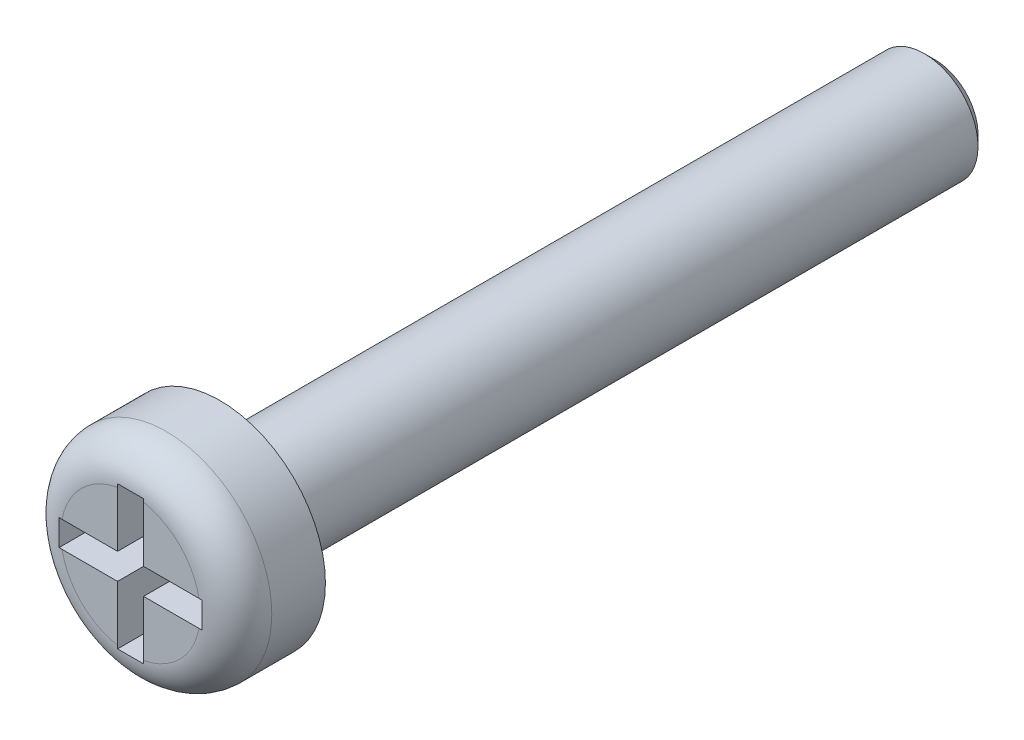
ISO-10303-21;
HEADER;
FILE_DESCRIPTION(('STEP AP214'),'2;1');
FILE_NAME('part.step','',(''),(''),'','','');
FILE_SCHEMA(('AUTOMOTIVE_DESIGN { 1 0 10303 214 1 1 1 1 }'));
ENDSEC;
DATA;
#1=APPLICATION_CONTEXT('core data for automotive mechanical design processes');
#2=APPLICATION_PROTOCOL_DEFINITION('international standard','automotive_design',2000,#1);
#3=PRODUCT_CONTEXT('',#1,'mechanical');
#4=PRODUCT('Part','Part','',(#3));
#5=PRODUCT_RELATED_PRODUCT_CATEGORY('part','',(#4));
#6=PRODUCT_DEFINITION_FORMATION('','',#4);
#7=PRODUCT_DEFINITION_CONTEXT('part definition',#1,'design');
#8=PRODUCT_DEFINITION('design','',#6,#7);
#9=PRODUCT_DEFINITION_SHAPE('','',#8);
#10=(LENGTH_UNIT() NAMED_UNIT(*) SI_UNIT(.MILLI.,.METRE.));
#11=(NAMED_UNIT(*) PLANE_ANGLE_UNIT() SI_UNIT($,.RADIAN.));
#12=(NAMED_UNIT(*) SI_UNIT($,.STERADIAN.) SOLID_ANGLE_UNIT());
#13=UNCERTAINTY_MEASURE_WITH_UNIT(LENGTH_MEASURE(1.E-05),#10,'distance_accuracy_value','');
#14=(GEOMETRIC_REPRESENTATION_CONTEXT(3) GLOBAL_UNCERTAINTY_ASSIGNED_CONTEXT((#13)) GLOBAL_UNIT_ASSIGNED_CONTEXT((#10,
#11,#12)) REPRESENTATION_CONTEXT('',''));
#15=CARTESIAN_POINT('',(0.,0.,0.));
#16=DIRECTION('',(0.,0.,1.));
#17=DIRECTION('',(1.,0.,0.));
#18=AXIS2_PLACEMENT_3D('',#15,#16,#17);
#19=CARTESIAN_POINT('',(0.,0.,2.5));
#20=DIRECTION('',(0.,0.,1.));
#21=DIRECTION('',(1.,0.,0.));
#22=AXIS2_PLACEMENT_3D('',#19,#20,#21);
#23=PLANE('',#22);
#24=DIRECTION('',(0.,-1.,0.));
#25=VECTOR('',#24,1.);
#26=CARTESIAN_POINT('',(-0.363589324194442,0.363589324194443,2.5));
#27=LINE('',#26,#25);
#28=CARTESIAN_POINT('',(-0.363589324194442,1.915803435463,2.5));
#29=VERTEX_POINT('',#28);
#30=CARTESIAN_POINT('',(-0.363589324194442,0.363589324194443,2.5));
#31=VERTEX_POINT('',#30);
#32=EDGE_CURVE('E217',#29,#31,#27,.T.);
#33=ORIENTED_EDGE('',*,*,#32,.F.);
#34=CARTESIAN_POINT('',(0.,0.,2.5));
#35=DIRECTION('',(0.,0.,1.));
#36=DIRECTION('',(1.,0.,0.));
#37=AXIS2_PLACEMENT_3D('',#34,#35,#36);
#38=CIRCLE('',#37,1.95);
#39=CARTESIAN_POINT('',(-1.915803435463,0.363589324194443,2.5));
#40=VERTEX_POINT('',#39);
#41=EDGE_CURVE('E269',#29,#40,#38,.T.);
#42=ORIENTED_EDGE('',*,*,#41,.T.);
#43=DIRECTION('',(-1.,0.,0.));
#44=VECTOR('',#43,1.);
#45=CARTESIAN_POINT('',(-2.,0.363589324194443,2.5));
#46=LINE('',#45,#44);
#47=EDGE_CURVE('E219',#31,#40,#46,.T.);
#48=ORIENTED_EDGE('',*,*,#47,.F.);
#49=EDGE_LOOP('',(#33,#42,#48));
#50=FACE_BOUND('',#49,.T.);
#51=ADVANCED_FACE('F37',(#50),#23,.T.);
#52=DIRECTION('',(1.,0.,0.));
#53=VECTOR('',#52,1.);
#54=CARTESIAN_POINT('',(-2.,-0.363589324194442,2.5));
#55=LINE('',#54,#53);
#56=CARTESIAN_POINT('',(-1.915803435463,-0.363589324194442,2.5));
#57=VERTEX_POINT('',#56);
#58=CARTESIAN_POINT('',(-0.363589324194442,-0.363589324194442,2.5));
#59=VERTEX_POINT('',#58);
#60=EDGE_CURVE('E182',#57,#59,#55,.T.);
#61=ORIENTED_EDGE('',*,*,#60,.F.);
#62=CARTESIAN_POINT('',(0.,0.,2.5));
#63=DIRECTION('',(0.,0.,1.));
#64=DIRECTION('',(1.,0.,0.));
#65=AXIS2_PLACEMENT_3D('',#62,#63,#64);
#66=CIRCLE('',#65,1.95);
#67=CARTESIAN_POINT('',(-0.363589324194442,-1.915803435463,2.5));
#68=VERTEX_POINT('',#67);
#69=EDGE_CURVE('E267',#57,#68,#66,.T.);
#70=ORIENTED_EDGE('',*,*,#69,.T.);
#71=DIRECTION('',(0.,-1.,0.));
#72=VECTOR('',#71,1.);
#73=CARTESIAN_POINT('',(-0.363589324194442,-2.,2.5));
#74=LINE('',#73,#72);
#75=EDGE_CURVE('E179',#59,#68,#74,.T.);
#76=ORIENTED_EDGE('',*,*,#75,.F.);
#77=EDGE_LOOP('',(#61,#70,#76));
#78=FACE_BOUND('',#77,.T.);
#79=ADVANCED_FACE('F386',(#78),#23,.T.);
#80=DIRECTION('',(0.,1.,0.));
#81=VECTOR('',#80,1.);
#82=CARTESIAN_POINT('',(0.363589324194442,-2.,2.5));
#83=LINE('',#82,#81);
#84=CARTESIAN_POINT('',(0.363589324194442,-1.915803435463,2.5));
#85=VERTEX_POINT('',#84);
#86=CARTESIAN_POINT('',(0.363589324194442,-0.363589324194442,2.5));
#87=VERTEX_POINT('',#86);
#88=EDGE_CURVE('E160',#85,#87,#83,.T.);
#89=ORIENTED_EDGE('',*,*,#88,.F.);
#90=CARTESIAN_POINT('',(0.,0.,2.5));
#91=DIRECTION('',(0.,0.,1.));
#92=DIRECTION('',(1.,0.,0.));
#93=AXIS2_PLACEMENT_3D('',#90,#91,#92);
#94=CIRCLE('',#93,1.95);
#95=CARTESIAN_POINT('',(1.915803435463,-0.363589324194442,2.5));
#96=VERTEX_POINT('',#95);
#97=EDGE_CURVE('E265',#85,#96,#94,.T.);
#98=ORIENTED_EDGE('',*,*,#97,.T.);
#99=DIRECTION('',(1.,0.,0.));
#100=VECTOR('',#99,1.);
#101=CARTESIAN_POINT('',(0.363589324194442,-0.363589324194442,2.5));
#102=LINE('',#101,#100);
#103=EDGE_CURVE('E211',#87,#96,#102,.T.);
#104=ORIENTED_EDGE('',*,*,#103,.F.);
#105=EDGE_LOOP('',(#89,#98,#104));
#106=FACE_BOUND('',#105,.T.);
#107=ADVANCED_FACE('F372',(#106),#23,.T.);
#108=CARTESIAN_POINT('',(0.,0.,0.));
#109=DIRECTION('',(0.,0.,1.));
#110=DIRECTION('',(1.,0.,0.));
#111=AXIS2_PLACEMENT_3D('',#108,#109,#110);
#112=PLANE('',#111);
#113=CARTESIAN_POINT('',(0.,0.,0.));
#114=DIRECTION('',(0.,0.,1.));
#115=DIRECTION('',(1.,0.,0.));
#116=AXIS2_PLACEMENT_3D('',#113,#114,#115);
#117=CIRCLE('',#116,2.95);
#118=CARTESIAN_POINT('',(2.95,0.,0.));
#119=VERTEX_POINT('',#118);
#120=EDGE_CURVE('E225',#119,#119,#117,.T.);
#121=ORIENTED_EDGE('',*,*,#120,.F.);
#122=EDGE_LOOP('',(#121));
#123=FACE_BOUND('',#122,.T.);
#124=CARTESIAN_POINT('',(0.,0.,0.));
#125=DIRECTION('',(0.,0.,1.));
#126=DIRECTION('',(1.,0.,0.));
#127=AXIS2_PLACEMENT_3D('',#124,#125,#126);
#128=CIRCLE('',#127,1.5);
#129=CARTESIAN_POINT('',(1.5,0.,0.));
#130=VERTEX_POINT('',#129);
#131=EDGE_CURVE('E254',#130,#130,#128,.F.);
#132=ORIENTED_EDGE('',*,*,#131,.F.);
#133=EDGE_LOOP('',(#132));
#134=FACE_BOUND('',#133,.T.);
#135=ADVANCED_FACE('F373',(#123,#134),#112,.F.);
#136=CARTESIAN_POINT('',(0.,0.,2.5));
#137=DIRECTION('',(0.,0.,-1.));
#138=DIRECTION('',(-1.,0.,0.));
#139=AXIS2_PLACEMENT_3D('',#136,#137,#138);
#140=CYLINDRICAL_SURFACE('',#139,2.95);
#141=CARTESIAN_POINT('',(0.,0.,1.5));
#142=DIRECTION('',(0.,0.,1.));
#143=DIRECTION('',(1.,0.,0.));
#144=AXIS2_PLACEMENT_3D('',#141,#142,#143);
#145=CIRCLE('',#144,2.95);
#146=CARTESIAN_POINT('',(2.95,0.,1.5));
#147=VERTEX_POINT('',#146);
#148=EDGE_CURVE('E11',#147,#147,#145,.F.);
#149=ORIENTED_EDGE('',*,*,#148,.T.);
#150=EDGE_LOOP('',(#149));
#151=FACE_BOUND('',#150,.T.);
#152=ORIENTED_EDGE('',*,*,#120,.T.);
#153=EDGE_LOOP('',(#152));
#154=FACE_BOUND('',#153,.T.);
#155=ADVANCED_FACE('F370',(#151,#154),#140,.T.);
#156=DIRECTION('',(-1.,0.,0.));
#157=VECTOR('',#156,1.);
#158=CARTESIAN_POINT('',(0.363589324194442,0.363589324194443,2.5));
#159=LINE('',#158,#157);
#160=CARTESIAN_POINT('',(1.915803435463,0.363589324194443,2.5));
#161=VERTEX_POINT('',#160);
#162=CARTESIAN_POINT('',(0.363589324194442,0.363589324194443,2.5));
#163=VERTEX_POINT('',#162);
#164=EDGE_CURVE('E213',#161,#163,#159,.T.);
#165=ORIENTED_EDGE('',*,*,#164,.F.);
#166=CARTESIAN_POINT('',(0.,0.,2.5));
#167=DIRECTION('',(0.,0.,1.));
#168=DIRECTION('',(1.,0.,0.));
#169=AXIS2_PLACEMENT_3D('',#166,#167,#168);
#170=CIRCLE('',#169,1.95);
#171=CARTESIAN_POINT('',(0.363589324194442,1.915803435463,2.5));
#172=VERTEX_POINT('',#171);
#173=EDGE_CURVE('E263',#161,#172,#170,.T.);
#174=ORIENTED_EDGE('',*,*,#173,.T.);
#175=DIRECTION('',(0.,1.,0.));
#176=VECTOR('',#175,1.);
#177=CARTESIAN_POINT('',(0.363589324194442,0.363589324194443,2.5));
#178=LINE('',#177,#176);
#179=EDGE_CURVE('E215',#163,#172,#178,.T.);
#180=ORIENTED_EDGE('',*,*,#179,.F.);
#181=EDGE_LOOP('',(#165,#174,#180));
#182=FACE_BOUND('',#181,.T.);
#183=ADVANCED_FACE('F366',(#182),#23,.T.);
#184=CARTESIAN_POINT('',(0.,0.,-20.));
#185=DIRECTION('',(0.,0.,1.));
#186=DIRECTION('',(1.,0.,0.));
#187=AXIS2_PLACEMENT_3D('',#184,#185,#186);
#188=CYLINDRICAL_SURFACE('',#187,1.5);
#189=CARTESIAN_POINT('',(0.,0.,-19.7));
#190=DIRECTION('',(0.,0.,-1.));
#191=DIRECTION('',(-1.,0.,0.));
#192=AXIS2_PLACEMENT_3D('',#189,#190,#191);
#193=CIRCLE('',#192,1.5);
#194=CARTESIAN_POINT('',(-1.5,0.,-19.7));
#195=VERTEX_POINT('',#194);
#196=EDGE_CURVE('E260',#195,#195,#193,.F.);
#197=ORIENTED_EDGE('',*,*,#196,.T.);
#198=EDGE_LOOP('',(#197));
#199=FACE_BOUND('',#198,.T.);
#200=ORIENTED_EDGE('',*,*,#131,.T.);
#201=EDGE_LOOP('',(#200));
#202=FACE_BOUND('',#201,.T.);
#203=ADVANCED_FACE('F362',(#199,#202),#188,.T.);
#204=CARTESIAN_POINT('',(0.,0.,-20.));
#205=DIRECTION('',(0.,0.,-1.));
#206=DIRECTION('',(-1.,0.,0.));
#207=AXIS2_PLACEMENT_3D('',#204,#205,#206);
#208=PLANE('',#207);
#209=CARTESIAN_POINT('',(0.,0.,-20.));
#210=DIRECTION('',(0.,0.,-1.));
#211=DIRECTION('',(-1.,0.,0.));
#212=AXIS2_PLACEMENT_3D('',#209,#210,#211);
#213=CIRCLE('',#212,1.2);
#214=CARTESIAN_POINT('',(-1.2,0.,-20.));
#215=VERTEX_POINT('',#214);
#216=EDGE_CURVE('E257',#215,#215,#213,.T.);
#217=ORIENTED_EDGE('',*,*,#216,.T.);
#218=EDGE_LOOP('',(#217));
#219=FACE_BOUND('',#218,.T.);
#220=ADVANCED_FACE('F359',(#219),#208,.T.);
#221=CARTESIAN_POINT('',(0.,0.,-20.));
#222=DIRECTION('',(0.,0.,1.));
#223=DIRECTION('',(1.,0.,0.));
#224=AXIS2_PLACEMENT_3D('',#221,#222,#223);
#225=CONICAL_SURFACE('',#224,1.2,0.785398163397447);
#226=ORIENTED_EDGE('',*,*,#196,.F.);
#227=EDGE_LOOP('',(#226));
#228=FACE_BOUND('',#227,.T.);
#229=ORIENTED_EDGE('',*,*,#216,.F.);
#230=EDGE_LOOP('',(#229));
#231=FACE_BOUND('',#230,.T.);
#232=ADVANCED_FACE('F358',(#228,#231),#225,.T.);
#233=CARTESIAN_POINT('',(0.363589324194442,-2.,0.5));
#234=DIRECTION('',(1.,0.,0.));
#235=DIRECTION('',(0.,0.,-1.));
#236=AXIS2_PLACEMENT_3D('',#233,#234,#235);
#237=PLANE('',#236);
#238=DIRECTION('',(0.,0.,1.));
#239=VECTOR('',#238,1.);
#240=CARTESIAN_POINT('',(0.363589324194442,-2.,0.5));
#241=LINE('',#240,#239);
#242=CARTESIAN_POINT('',(0.363589324194442,-2.,0.5));
#243=VERTEX_POINT('',#242);
#244=CARTESIAN_POINT('',(0.363589324194442,-2.,2.49656779144265));
#245=VERTEX_POINT('',#244);
#246=EDGE_CURVE('E223',#243,#245,#241,.T.);
#247=ORIENTED_EDGE('',*,*,#246,.T.);
#248=CARTESIAN_POINT('',(0.363589324194442,-2.,2.49656779144265));
#249=CARTESIAN_POINT('',(0.363589324194442,-1.98599056173165,2.49771205782613));
#250=CARTESIAN_POINT('',(0.363589324194442,-1.97196946017275,2.49857020839763));
#251=CARTESIAN_POINT('',(0.363589324194442,-1.94390393864683,2.49971427758346));
#252=CARTESIAN_POINT('',(0.363589324194442,-1.92985951869339,2.50000019653109));
#253=CARTESIAN_POINT('',(0.363589324194442,-1.915803435463,2.5));
#254=B_SPLINE_CURVE_WITH_KNOTS('',3,(#248,#249,#250,#251,#252,#253),.UNSPECIFIED.,.F.,.F.,(4,2,
4),(0.,0.0421420146878945,0.084284004831425),.UNSPECIFIED.);
#255=EDGE_CURVE('E343',#245,#85,#254,.T.);
#256=ORIENTED_EDGE('',*,*,#255,.T.);
#257=ORIENTED_EDGE('',*,*,#88,.T.);
#258=DIRECTION('',(0.,0.,1.));
#259=VECTOR('',#258,1.);
#260=CARTESIAN_POINT('',(0.363589324194442,-0.363589324194442,0.5));
#261=LINE('',#260,#259);
#262=CARTESIAN_POINT('',(0.363589324194442,-0.363589324194442,0.5));
#263=VERTEX_POINT('',#262);
#264=EDGE_CURVE('E152',#263,#87,#261,.T.);
#265=ORIENTED_EDGE('',*,*,#264,.F.);
#266=DIRECTION('',(0.,1.,0.));
#267=VECTOR('',#266,1.);
#268=CARTESIAN_POINT('',(0.363589324194442,-2.,0.5));
#269=LINE('',#268,#267);
#270=EDGE_CURVE('E157',#243,#263,#269,.T.);
#271=ORIENTED_EDGE('',*,*,#270,.F.);
#272=EDGE_LOOP('',(#247,#256,#257,#265,#271));
#273=FACE_BOUND('',#272,.T.);
#274=ADVANCED_FACE('F155',(#273),#237,.F.);
#275=CARTESIAN_POINT('',(-0.363589324194442,-2.,0.5));
#276=DIRECTION('',(0.,-1.,0.));
#277=DIRECTION('',(0.,0.,-1.));
#278=AXIS2_PLACEMENT_3D('',#275,#276,#277);
#279=PLANE('',#278);
#280=DIRECTION('',(0.,0.,1.));
#281=VECTOR('',#280,1.);
#282=CARTESIAN_POINT('',(-0.363589324194442,-2.,0.5));
#283=LINE('',#282,#281);
#284=CARTESIAN_POINT('',(-0.363589324194442,-2.,0.5));
#285=VERTEX_POINT('',#284);
#286=CARTESIAN_POINT('',(-0.363589324194442,-2.,2.49656779144265));
#287=VERTEX_POINT('',#286);
#288=EDGE_CURVE('E226',#285,#287,#283,.T.);
#289=ORIENTED_EDGE('',*,*,#288,.T.);
#290=CARTESIAN_POINT('',(-0.363589324194442,-2.,2.49656779144265));
#291=CARTESIAN_POINT('',(-0.302993422672167,-2.,2.4974261728027));
#292=CARTESIAN_POINT('',(-0.242394946107263,-2.,2.49797153365682));
#293=CARTESIAN_POINT('',(-0.12119764629845,-2.,2.4986330482506));
#294=CARTESIAN_POINT('',(-0.060598823149225,-2.,2.49874921777191));
#295=CARTESIAN_POINT('',(0.0605988231492249,-2.,2.49874921777191));
#296=CARTESIAN_POINT('',(0.12119764629845,-2.,2.4986330482506));
#297=CARTESIAN_POINT('',(0.242394946107262,-2.,2.49797153365682));
#298=CARTESIAN_POINT('',(0.302993422672167,-2.,2.4974261728027));
#299=CARTESIAN_POINT('',(0.363589324194442,-2.,2.49656779144265));
#300=B_SPLINE_CURVE_WITH_KNOTS('',3,(#290,#291,#292,#293,#294,#295,#296,#297,#298,#299),
.UNSPECIFIED.,.F.,.F.,(4,2,2,2,4),(0.,0.181802416457,0.363598147850277,0.545393879243555,
0.727196295700555),.UNSPECIFIED.);
#301=EDGE_CURVE('E348',#287,#245,#300,.T.);
#302=ORIENTED_EDGE('',*,*,#301,.T.);
#303=ORIENTED_EDGE('',*,*,#246,.F.);
#304=DIRECTION('',(1.,0.,0.));
#305=VECTOR('',#304,1.);
#306=CARTESIAN_POINT('',(-0.363589324194442,-2.,0.5));
#307=LINE('',#306,#305);
#308=EDGE_CURVE('E165',#285,#243,#307,.T.);
#309=ORIENTED_EDGE('',*,*,#308,.F.);
#310=EDGE_LOOP('',(#289,#302,#303,#309));
#311=FACE_BOUND('',#310,.T.);
#312=ADVANCED_FACE('F357',(#311),#279,.F.);
#313=CARTESIAN_POINT('',(-0.363589324194442,-2.,0.5));
#314=DIRECTION('',(-1.,0.,0.));
#315=DIRECTION('',(0.,-1.,0.));
#316=AXIS2_PLACEMENT_3D('',#313,#314,#315);
#317=PLANE('',#316);
#318=ORIENTED_EDGE('',*,*,#75,.T.);
#319=CARTESIAN_POINT('',(-0.363589324194442,-1.915803435463,2.5));
#320=CARTESIAN_POINT('',(-0.363589324194442,-1.92985951869339,2.50000019653109));
#321=CARTESIAN_POINT('',(-0.363589324194442,-1.94390393864683,2.49971427758346));
#322=CARTESIAN_POINT('',(-0.363589324194442,-1.97196946017275,2.49857020839763));
#323=CARTESIAN_POINT('',(-0.363589324194442,-1.98599056173165,2.49771205782613));
#324=CARTESIAN_POINT('',(-0.363589324194442,-2.,2.49656779144265));
#325=B_SPLINE_CURVE_WITH_KNOTS('',3,(#319,#320,#321,#322,#323,#324),.UNSPECIFIED.,.F.,.F.,(4,2,
4),(0.,0.0421419901435307,0.0842840048314248),.UNSPECIFIED.);
#326=EDGE_CURVE('E562',#68,#287,#325,.T.);
#327=ORIENTED_EDGE('',*,*,#326,.T.);
#328=ORIENTED_EDGE('',*,*,#288,.F.);
#329=DIRECTION('',(0.,-1.,0.));
#330=VECTOR('',#329,1.);
#331=CARTESIAN_POINT('',(-0.363589324194442,-2.,0.5));
#332=LINE('',#331,#330);
#333=CARTESIAN_POINT('',(-0.363589324194442,-0.363589324194442,0.5));
#334=VERTEX_POINT('',#333);
#335=EDGE_CURVE('E207',#334,#285,#332,.T.);
#336=ORIENTED_EDGE('',*,*,#335,.F.);
#337=DIRECTION('',(0.,0.,1.));
#338=VECTOR('',#337,1.);
#339=CARTESIAN_POINT('',(-0.363589324194442,-0.363589324194442,0.5));
#340=LINE('',#339,#338);
#341=EDGE_CURVE('E229',#334,#59,#340,.T.);
#342=ORIENTED_EDGE('',*,*,#341,.T.);
#343=EDGE_LOOP('',(#318,#327,#328,#336,#342));
#344=FACE_BOUND('',#343,.T.);
#345=ADVANCED_FACE('F534',(#344),#317,.F.);
#346=CARTESIAN_POINT('',(-2.,-0.363589324194442,0.5));
#347=DIRECTION('',(0.,-1.,0.));
#348=DIRECTION('',(0.,0.,-1.));
#349=AXIS2_PLACEMENT_3D('',#346,#347,#348);
#350=PLANE('',#349);
#351=DIRECTION('',(0.,0.,1.));
#352=VECTOR('',#351,1.);
#353=CARTESIAN_POINT('',(-2.,-0.363589324194442,0.5));
#354=LINE('',#353,#352);
#355=CARTESIAN_POINT('',(-2.,-0.363589324194442,0.5));
#356=VERTEX_POINT('',#355);
#357=CARTESIAN_POINT('',(-2.,-0.363589324194442,2.49656779144265));
#358=VERTEX_POINT('',#357);
#359=EDGE_CURVE('E232',#356,#358,#354,.T.);
#360=ORIENTED_EDGE('',*,*,#359,.T.);
#361=CARTESIAN_POINT('',(-2.,-0.363589324194442,2.49656779144265));
#362=CARTESIAN_POINT('',(-1.98599056173165,-0.363589324194442,2.49771205782613));
#363=CARTESIAN_POINT('',(-1.97196946017275,-0.363589324194442,2.49857020839763));
#364=CARTESIAN_POINT('',(-1.94390393864683,-0.363589324194442,2.49971427758346));
#365=CARTESIAN_POINT('',(-1.92985951869339,-0.363589324194442,2.50000019653109));
#366=CARTESIAN_POINT('',(-1.915803435463,-0.363589324194442,2.5));
#367=B_SPLINE_CURVE_WITH_KNOTS('',3,(#361,#362,#363,#364,#365,#366),.UNSPECIFIED.,.F.,.F.,(4,2,
4),(0.,0.0421420146878945,0.0842840048314257),.UNSPECIFIED.);
#368=EDGE_CURVE('E566',#358,#57,#367,.T.);
#369=ORIENTED_EDGE('',*,*,#368,.T.);
#370=ORIENTED_EDGE('',*,*,#60,.T.);
#371=ORIENTED_EDGE('',*,*,#341,.F.);
#372=DIRECTION('',(1.,0.,0.));
#373=VECTOR('',#372,1.);
#374=CARTESIAN_POINT('',(-2.,-0.363589324194442,0.5));
#375=LINE('',#374,#373);
#376=EDGE_CURVE('E204',#356,#334,#375,.T.);
#377=ORIENTED_EDGE('',*,*,#376,.F.);
#378=EDGE_LOOP('',(#360,#369,#370,#371,#377));
#379=FACE_BOUND('',#378,.T.);
#380=ADVANCED_FACE('F526',(#379),#350,.F.);
#381=CARTESIAN_POINT('',(-2.,-0.363589324194442,0.5));
#382=DIRECTION('',(-1.,0.,0.));
#383=DIRECTION('',(0.,0.,1.));
#384=AXIS2_PLACEMENT_3D('',#381,#382,#383);
#385=PLANE('',#384);
#386=DIRECTION('',(0.,0.,1.));
#387=VECTOR('',#386,1.);
#388=CARTESIAN_POINT('',(-2.,0.363589324194443,0.5));
#389=LINE('',#388,#387);
#390=CARTESIAN_POINT('',(-2.,0.363589324194443,0.5));
#391=VERTEX_POINT('',#390);
#392=CARTESIAN_POINT('',(-2.,0.363589324194443,2.49656779144265));
#393=VERTEX_POINT('',#392);
#394=EDGE_CURVE('E235',#391,#393,#389,.T.);
#395=ORIENTED_EDGE('',*,*,#394,.T.);
#396=CARTESIAN_POINT('',(-2.,0.363589324194443,2.49656779144265));
#397=CARTESIAN_POINT('',(-2.,0.302993422672167,2.4974261728027));
#398=CARTESIAN_POINT('',(-2.,0.242394946107263,2.49797153365682));
#399=CARTESIAN_POINT('',(-2.,0.12119764629845,2.4986330482506));
#400=CARTESIAN_POINT('',(-2.,0.0605988231492253,2.49874921777191));
#401=CARTESIAN_POINT('',(-2.,-0.0605988231492247,2.49874921777191));
#402=CARTESIAN_POINT('',(-2.,-0.12119764629845,2.4986330482506));
#403=CARTESIAN_POINT('',(-2.,-0.242394946107262,2.49797153365682));
#404=CARTESIAN_POINT('',(-2.,-0.302993422672167,2.4974261728027));
#405=CARTESIAN_POINT('',(-2.,-0.363589324194442,2.49656779144265));
#406=B_SPLINE_CURVE_WITH_KNOTS('',3,(#396,#397,#398,#399,#400,#401,#402,#403,#404,#405),
.UNSPECIFIED.,.F.,.F.,(4,2,2,2,4),(0.,0.181802416457,0.363598147850278,0.545393879243555,
0.727196295700555),.UNSPECIFIED.);
#407=EDGE_CURVE('E278',#393,#358,#406,.T.);
#408=ORIENTED_EDGE('',*,*,#407,.T.);
#409=ORIENTED_EDGE('',*,*,#359,.F.);
#410=DIRECTION('',(0.,-1.,0.));
#411=VECTOR('',#410,1.);
#412=CARTESIAN_POINT('',(-2.,-0.363589324194442,0.5));
#413=LINE('',#412,#411);
#414=EDGE_CURVE('E201',#391,#356,#413,.T.);
#415=ORIENTED_EDGE('',*,*,#414,.F.);
#416=EDGE_LOOP('',(#395,#408,#409,#415));
#417=FACE_BOUND('',#416,.T.);
#418=ADVANCED_FACE('F289',(#417),#385,.F.);
#419=CARTESIAN_POINT('',(-2.,0.363589324194443,0.5));
#420=DIRECTION('',(0.,1.,0.));
#421=DIRECTION('',(0.,0.,1.));
#422=AXIS2_PLACEMENT_3D('',#419,#420,#421);
#423=PLANE('',#422);
#424=ORIENTED_EDGE('',*,*,#47,.T.);
#425=CARTESIAN_POINT('',(-1.915803435463,0.363589324194443,2.5));
#426=CARTESIAN_POINT('',(-1.92985951869339,0.363589324194443,2.50000019653109));
#427=CARTESIAN_POINT('',(-1.94390393864683,0.363589324194443,2.49971427758346));
#428=CARTESIAN_POINT('',(-1.97196946017275,0.363589324194443,2.49857020839763));
#429=CARTESIAN_POINT('',(-1.98599056173165,0.363589324194443,2.49771205782613));
#430=CARTESIAN_POINT('',(-2.,0.363589324194443,2.49656779144265));
#431=B_SPLINE_CURVE_WITH_KNOTS('',3,(#425,#426,#427,#428,#429,#430),.UNSPECIFIED.,.F.,.F.,(4,2,
4),(0.,0.0421419901435309,0.0842840048314254),.UNSPECIFIED.);
#432=EDGE_CURVE('E272',#40,#393,#431,.T.);
#433=ORIENTED_EDGE('',*,*,#432,.T.);
#434=ORIENTED_EDGE('',*,*,#394,.F.);
#435=DIRECTION('',(-1.,0.,0.));
#436=VECTOR('',#435,1.);
#437=CARTESIAN_POINT('',(-2.,0.363589324194443,0.5));
#438=LINE('',#437,#436);
#439=CARTESIAN_POINT('',(-0.363589324194442,0.363589324194443,0.5));
#440=VERTEX_POINT('',#439);
#441=EDGE_CURVE('E198',#440,#391,#438,.T.);
#442=ORIENTED_EDGE('',*,*,#441,.F.);
#443=DIRECTION('',(0.,0.,1.));
#444=VECTOR('',#443,1.);
#445=CARTESIAN_POINT('',(-0.363589324194442,0.363589324194443,0.5));
#446=LINE('',#445,#444);
#447=EDGE_CURVE('E238',#440,#31,#446,.T.);
#448=ORIENTED_EDGE('',*,*,#447,.T.);
#449=EDGE_LOOP('',(#424,#433,#434,#442,#448));
#450=FACE_BOUND('',#449,.T.);
#451=ADVANCED_FACE('F284',(#450),#423,.F.);
#452=CARTESIAN_POINT('',(-0.363589324194442,0.363589324194443,0.5));
#453=DIRECTION('',(-1.,0.,0.));
#454=DIRECTION('',(0.,-1.,0.));
#455=AXIS2_PLACEMENT_3D('',#452,#453,#454);
#456=PLANE('',#455);
#457=DIRECTION('',(0.,0.,1.));
#458=VECTOR('',#457,1.);
#459=CARTESIAN_POINT('',(-0.363589324194442,2.,0.5));
#460=LINE('',#459,#458);
#461=CARTESIAN_POINT('',(-0.363589324194442,2.,0.5));
#462=VERTEX_POINT('',#461);
#463=CARTESIAN_POINT('',(-0.363589324194442,2.,2.49656779144265));
#464=VERTEX_POINT('',#463);
#465=EDGE_CURVE('E241',#462,#464,#460,.T.);
#466=ORIENTED_EDGE('',*,*,#465,.T.);
#467=CARTESIAN_POINT('',(-0.363589324194442,2.,2.49656779144265));
#468=CARTESIAN_POINT('',(-0.363589324194442,1.98599056173165,2.49771205782613));
#469=CARTESIAN_POINT('',(-0.363589324194442,1.97196946017275,2.49857020839763));
#470=CARTESIAN_POINT('',(-0.363589324194442,1.94390393864683,2.49971427758346));
#471=CARTESIAN_POINT('',(-0.363589324194442,1.92985951869339,2.50000019653109));
#472=CARTESIAN_POINT('',(-0.363589324194442,1.915803435463,2.5));
#473=B_SPLINE_CURVE_WITH_KNOTS('',3,(#467,#468,#469,#470,#471,#472),.UNSPECIFIED.,.F.,.F.,(4,2,
4),(0.,0.0421420146878945,0.084284004831425),.UNSPECIFIED.);
#474=EDGE_CURVE('E46',#464,#29,#473,.T.);
#475=ORIENTED_EDGE('',*,*,#474,.T.);
#476=ORIENTED_EDGE('',*,*,#32,.T.);
#477=ORIENTED_EDGE('',*,*,#447,.F.);
#478=DIRECTION('',(0.,-1.,0.));
#479=VECTOR('',#478,1.);
#480=CARTESIAN_POINT('',(-0.363589324194442,0.363589324194443,0.5));
#481=LINE('',#480,#479);
#482=EDGE_CURVE('E195',#462,#440,#481,.T.);
#483=ORIENTED_EDGE('',*,*,#482,.F.);
#484=EDGE_LOOP('',(#466,#475,#476,#477,#483));
#485=FACE_BOUND('',#484,.T.);
#486=ADVANCED_FACE('F288',(#485),#456,.F.);
#487=CARTESIAN_POINT('',(-0.363589324194442,2.,0.5));
#488=DIRECTION('',(0.,1.,0.));
#489=DIRECTION('',(0.,0.,1.));
#490=AXIS2_PLACEMENT_3D('',#487,#488,#489);
#491=PLANE('',#490);
#492=DIRECTION('',(0.,0.,1.));
#493=VECTOR('',#492,1.);
#494=CARTESIAN_POINT('',(0.363589324194442,2.,0.5));
#495=LINE('',#494,#493);
#496=CARTESIAN_POINT('',(0.363589324194442,2.,0.5));
#497=VERTEX_POINT('',#496);
#498=CARTESIAN_POINT('',(0.363589324194442,2.,2.49656779144265));
#499=VERTEX_POINT('',#498);
#500=EDGE_CURVE('E243',#497,#499,#495,.T.);
#501=ORIENTED_EDGE('',*,*,#500,.T.);
#502=CARTESIAN_POINT('',(0.363589324194442,2.,2.49656779144265));
#503=CARTESIAN_POINT('',(0.302993422672167,2.,2.4974261728027));
#504=CARTESIAN_POINT('',(0.242394946107263,2.,2.49797153365682));
#505=CARTESIAN_POINT('',(0.12119764629845,2.,2.4986330482506));
#506=CARTESIAN_POINT('',(0.0605988231492249,2.,2.49874921777191));
#507=CARTESIAN_POINT('',(-0.060598823149225,2.,2.49874921777191));
#508=CARTESIAN_POINT('',(-0.12119764629845,2.,2.4986330482506));
#509=CARTESIAN_POINT('',(-0.242394946107263,2.,2.49797153365682));
#510=CARTESIAN_POINT('',(-0.302993422672167,2.,2.4974261728027));
#511=CARTESIAN_POINT('',(-0.363589324194442,2.,2.49656779144265));
#512=B_SPLINE_CURVE_WITH_KNOTS('',3,(#502,#503,#504,#505,#506,#507,#508,#509,#510,#511),
.UNSPECIFIED.,.F.,.F.,(4,2,2,2,4),(0.,0.181802416457,0.363598147850278,0.545393879243555,
0.727196295700555),.UNSPECIFIED.);
#513=EDGE_CURVE('E53',#499,#464,#512,.T.);
#514=ORIENTED_EDGE('',*,*,#513,.T.);
#515=ORIENTED_EDGE('',*,*,#465,.F.);
#516=DIRECTION('',(-1.,0.,0.));
#517=VECTOR('',#516,1.);
#518=CARTESIAN_POINT('',(-0.363589324194442,2.,0.5));
#519=LINE('',#518,#517);
#520=EDGE_CURVE('E192',#497,#462,#519,.T.);
#521=ORIENTED_EDGE('',*,*,#520,.F.);
#522=EDGE_LOOP('',(#501,#514,#515,#521));
#523=FACE_BOUND('',#522,.T.);
#524=ADVANCED_FACE('F296',(#523),#491,.F.);
#525=CARTESIAN_POINT('',(0.363589324194442,0.363589324194443,0.5));
#526=DIRECTION('',(1.,0.,0.));
#527=DIRECTION('',(0.,0.,-1.));
#528=AXIS2_PLACEMENT_3D('',#525,#526,#527);
#529=PLANE('',#528);
#530=ORIENTED_EDGE('',*,*,#179,.T.);
#531=CARTESIAN_POINT('',(0.363589324194442,1.915803435463,2.5));
#532=CARTESIAN_POINT('',(0.363589324194442,1.92985951869339,2.50000019653109));
#533=CARTESIAN_POINT('',(0.363589324194442,1.94390393864683,2.49971427758346));
#534=CARTESIAN_POINT('',(0.363589324194442,1.97196946017275,2.49857020839763));
#535=CARTESIAN_POINT('',(0.363589324194442,1.98599056173165,2.49771205782613));
#536=CARTESIAN_POINT('',(0.363589324194442,2.,2.49656779144265));
#537=B_SPLINE_CURVE_WITH_KNOTS('',3,(#531,#532,#533,#534,#535,#536),.UNSPECIFIED.,.F.,.F.,(4,2,
4),(0.,0.0421419901435307,0.0842840048314248),.UNSPECIFIED.);
#538=EDGE_CURVE('E61',#172,#499,#537,.T.);
#539=ORIENTED_EDGE('',*,*,#538,.T.);
#540=ORIENTED_EDGE('',*,*,#500,.F.);
#541=DIRECTION('',(0.,1.,0.));
#542=VECTOR('',#541,1.);
#543=CARTESIAN_POINT('',(0.363589324194442,0.363589324194443,0.5));
#544=LINE('',#543,#542);
#545=CARTESIAN_POINT('',(0.363589324194442,0.363589324194443,0.5));
#546=VERTEX_POINT('',#545);
#547=EDGE_CURVE('E189',#546,#497,#544,.T.);
#548=ORIENTED_EDGE('',*,*,#547,.F.);
#549=DIRECTION('',(0.,0.,1.));
#550=VECTOR('',#549,1.);
#551=CARTESIAN_POINT('',(0.363589324194442,0.363589324194443,0.5));
#552=LINE('',#551,#550);
#553=EDGE_CURVE('E245',#546,#163,#552,.T.);
#554=ORIENTED_EDGE('',*,*,#553,.T.);
#555=EDGE_LOOP('',(#530,#539,#540,#548,#554));
#556=FACE_BOUND('',#555,.T.);
#557=ADVANCED_FACE('F318',(#556),#529,.F.);
#558=CARTESIAN_POINT('',(0.363589324194442,0.363589324194443,0.5));
#559=DIRECTION('',(0.,1.,0.));
#560=DIRECTION('',(0.,0.,1.));
#561=AXIS2_PLACEMENT_3D('',#558,#559,#560);
#562=PLANE('',#561);
#563=DIRECTION('',(0.,0.,1.));
#564=VECTOR('',#563,1.);
#565=CARTESIAN_POINT('',(2.,0.363589324194443,0.5));
#566=LINE('',#565,#564);
#567=CARTESIAN_POINT('',(2.,0.363589324194443,0.5));
#568=VERTEX_POINT('',#567);
#569=CARTESIAN_POINT('',(2.,0.363589324194443,2.49656779144265));
#570=VERTEX_POINT('',#569);
#571=EDGE_CURVE('E248',#568,#570,#566,.T.);
#572=ORIENTED_EDGE('',*,*,#571,.T.);
#573=CARTESIAN_POINT('',(2.,0.363589324194443,2.49656779144265));
#574=CARTESIAN_POINT('',(1.98599056173165,0.363589324194443,2.49771205782613));
#575=CARTESIAN_POINT('',(1.97196946017275,0.363589324194443,2.49857020839763));
#576=CARTESIAN_POINT('',(1.94390393864683,0.363589324194443,2.49971427758346));
#577=CARTESIAN_POINT('',(1.92985951869339,0.363589324194443,2.50000019653109));
#578=CARTESIAN_POINT('',(1.915803435463,0.363589324194443,2.5));
#579=B_SPLINE_CURVE_WITH_KNOTS('',3,(#573,#574,#575,#576,#577,#578),.UNSPECIFIED.,.F.,.F.,(4,2,
4),(0.,0.0421420146878945,0.0842840048314257),.UNSPECIFIED.);
#580=EDGE_CURVE('E312',#570,#161,#579,.T.);
#581=ORIENTED_EDGE('',*,*,#580,.T.);
#582=ORIENTED_EDGE('',*,*,#164,.T.);
#583=ORIENTED_EDGE('',*,*,#553,.F.);
#584=DIRECTION('',(-1.,0.,0.));
#585=VECTOR('',#584,1.);
#586=CARTESIAN_POINT('',(0.363589324194442,0.363589324194443,0.5));
#587=LINE('',#586,#585);
#588=EDGE_CURVE('E186',#568,#546,#587,.T.);
#589=ORIENTED_EDGE('',*,*,#588,.F.);
#590=EDGE_LOOP('',(#572,#581,#582,#583,#589));
#591=FACE_BOUND('',#590,.T.);
#592=ADVANCED_FACE('F321',(#591),#562,.F.);
#593=CARTESIAN_POINT('',(2.,-0.363589324194442,0.5));
#594=DIRECTION('',(1.,0.,0.));
#595=DIRECTION('',(0.,0.,-1.));
#596=AXIS2_PLACEMENT_3D('',#593,#594,#595);
#597=PLANE('',#596);
#598=DIRECTION('',(0.,0.,1.));
#599=VECTOR('',#598,1.);
#600=CARTESIAN_POINT('',(2.,-0.363589324194442,0.5));
#601=LINE('',#600,#599);
#602=CARTESIAN_POINT('',(2.,-0.363589324194442,0.5));
#603=VERTEX_POINT('',#602);
#604=CARTESIAN_POINT('',(2.,-0.363589324194442,2.49656779144265));
#605=VERTEX_POINT('',#604);
#606=EDGE_CURVE('E164',#603,#605,#601,.T.);
#607=ORIENTED_EDGE('',*,*,#606,.T.);
#608=CARTESIAN_POINT('',(2.,-0.363589324194442,2.49656779144265));
#609=CARTESIAN_POINT('',(2.,-0.302993422672167,2.4974261728027));
#610=CARTESIAN_POINT('',(2.,-0.242394946107262,2.49797153365682));
#611=CARTESIAN_POINT('',(2.,-0.12119764629845,2.4986330482506));
#612=CARTESIAN_POINT('',(2.,-0.0605988231492247,2.49874921777191));
#613=CARTESIAN_POINT('',(2.,0.0605988231492252,2.49874921777191));
#614=CARTESIAN_POINT('',(2.,0.12119764629845,2.4986330482506));
#615=CARTESIAN_POINT('',(2.,0.242394946107263,2.49797153365682));
#616=CARTESIAN_POINT('',(2.,0.302993422672167,2.4974261728027));
#617=CARTESIAN_POINT('',(2.,0.363589324194443,2.49656779144265));
#618=B_SPLINE_CURVE_WITH_KNOTS('',3,(#608,#609,#610,#611,#612,#613,#614,#615,#616,#617),
.UNSPECIFIED.,.F.,.F.,(4,2,2,2,4),(0.,0.181802416457,0.363598147850278,0.545393879243555,
0.727196295700555),.UNSPECIFIED.);
#619=EDGE_CURVE('E333',#605,#570,#618,.T.);
#620=ORIENTED_EDGE('',*,*,#619,.T.);
#621=ORIENTED_EDGE('',*,*,#571,.F.);
#622=DIRECTION('',(0.,1.,0.));
#623=VECTOR('',#622,1.);
#624=CARTESIAN_POINT('',(2.,-0.363589324194442,0.5));
#625=LINE('',#624,#623);
#626=EDGE_CURVE('E174',#603,#568,#625,.T.);
#627=ORIENTED_EDGE('',*,*,#626,.F.);
#628=EDGE_LOOP('',(#607,#620,#621,#627));
#629=FACE_BOUND('',#628,.T.);
#630=ADVANCED_FACE('F325',(#629),#597,.F.);
#631=CARTESIAN_POINT('',(0.363589324194442,-0.363589324194442,0.5));
#632=DIRECTION('',(0.,-1.,0.));
#633=DIRECTION('',(0.,0.,-1.));
#634=AXIS2_PLACEMENT_3D('',#631,#632,#633);
#635=PLANE('',#634);
#636=ORIENTED_EDGE('',*,*,#103,.T.);
#637=CARTESIAN_POINT('',(1.915803435463,-0.363589324194442,2.5));
#638=CARTESIAN_POINT('',(1.92985951869339,-0.363589324194442,2.50000019653109));
#639=CARTESIAN_POINT('',(1.94390393864683,-0.363589324194442,2.49971427758346));
#640=CARTESIAN_POINT('',(1.97196946017275,-0.363589324194442,2.49857020839763));
#641=CARTESIAN_POINT('',(1.98599056173165,-0.363589324194442,2.49771205782613));
#642=CARTESIAN_POINT('',(2.,-0.363589324194442,2.49656779144265));
#643=B_SPLINE_CURVE_WITH_KNOTS('',3,(#637,#638,#639,#640,#641,#642),.UNSPECIFIED.,.F.,.F.,(4,2,
4),(0.,0.0421419901435309,0.0842840048314254),.UNSPECIFIED.);
#644=EDGE_CURVE('E338',#96,#605,#643,.T.);
#645=ORIENTED_EDGE('',*,*,#644,.T.);
#646=ORIENTED_EDGE('',*,*,#606,.F.);
#647=DIRECTION('',(1.,0.,0.));
#648=VECTOR('',#647,1.);
#649=CARTESIAN_POINT('',(0.363589324194442,-0.363589324194442,0.5));
#650=LINE('',#649,#648);
#651=EDGE_CURVE('E168',#263,#603,#650,.T.);
#652=ORIENTED_EDGE('',*,*,#651,.F.);
#653=ORIENTED_EDGE('',*,*,#264,.T.);
#654=EDGE_LOOP('',(#636,#645,#646,#652,#653));
#655=FACE_BOUND('',#654,.T.);
#656=ADVANCED_FACE('F169',(#655),#635,.F.);
#657=CARTESIAN_POINT('',(0.,0.,0.5));
#658=DIRECTION('',(0.,0.,-1.));
#659=DIRECTION('',(-1.,0.,0.));
#660=AXIS2_PLACEMENT_3D('',#657,#658,#659);
#661=PLANE('',#660);
#662=ORIENTED_EDGE('',*,*,#270,.T.);
#663=ORIENTED_EDGE('',*,*,#651,.T.);
#664=ORIENTED_EDGE('',*,*,#626,.T.);
#665=ORIENTED_EDGE('',*,*,#588,.T.);
#666=ORIENTED_EDGE('',*,*,#547,.T.);
#667=ORIENTED_EDGE('',*,*,#520,.T.);
#668=ORIENTED_EDGE('',*,*,#482,.T.);
#669=ORIENTED_EDGE('',*,*,#441,.T.);
#670=ORIENTED_EDGE('',*,*,#414,.T.);
#671=ORIENTED_EDGE('',*,*,#376,.T.);
#672=ORIENTED_EDGE('',*,*,#335,.T.);
#673=ORIENTED_EDGE('',*,*,#308,.T.);
#674=EDGE_LOOP('',(#662,#663,#664,#665,#666,#667,#668,#669,#670,#671,#672,#673));
#675=FACE_BOUND('',#674,.T.);
#676=ADVANCED_FACE('F176',(#675),#661,.F.);
#677=CARTESIAN_POINT('',(0.,0.,1.5));
#678=DIRECTION('',(0.,0.,1.));
#679=DIRECTION('',(1.,0.,0.));
#680=AXIS2_PLACEMENT_3D('',#677,#678,#679);
#681=TOROIDAL_SURFACE('',#680,1.95,1.);
#682=ORIENTED_EDGE('',*,*,#148,.F.);
#683=EDGE_LOOP('',(#682));
#684=FACE_BOUND('',#683,.T.);
#685=ORIENTED_EDGE('',*,*,#432,.F.);
#686=ORIENTED_EDGE('',*,*,#41,.F.);
#687=ORIENTED_EDGE('',*,*,#474,.F.);
#688=ORIENTED_EDGE('',*,*,#513,.F.);
#689=ORIENTED_EDGE('',*,*,#538,.F.);
#690=ORIENTED_EDGE('',*,*,#173,.F.);
#691=ORIENTED_EDGE('',*,*,#580,.F.);
#692=ORIENTED_EDGE('',*,*,#619,.F.);
#693=ORIENTED_EDGE('',*,*,#644,.F.);
#694=ORIENTED_EDGE('',*,*,#97,.F.);
#695=ORIENTED_EDGE('',*,*,#255,.F.);
#696=ORIENTED_EDGE('',*,*,#301,.F.);
#697=ORIENTED_EDGE('',*,*,#326,.F.);
#698=ORIENTED_EDGE('',*,*,#69,.F.);
#699=ORIENTED_EDGE('',*,*,#368,.F.);
#700=ORIENTED_EDGE('',*,*,#407,.F.);
#701=EDGE_LOOP('',(#685,#686,#687,#688,#689,#690,#691,#692,#693,#694,#695,#696,#697,#698,#699,#700));
#702=FACE_BOUND('',#701,.T.);
#703=ADVANCED_FACE('F39',(#684,#702),#681,.T.);
#704=CLOSED_SHELL('',(#51,#79,#107,#135,#155,#183,#203,#220,#232,#274,#312,#345,#380,#418,#451,
#486,#524,#557,#592,#630,#656,#676,#703));
#705=MANIFOLD_SOLID_BREP('B2',#704);
#706=ADVANCED_BREP_SHAPE_REPRESENTATION('',(#18,#705),#14);
#707=SHAPE_DEFINITION_REPRESENTATION(#9,#706);
ENDSEC;
END-ISO-10303-21;
